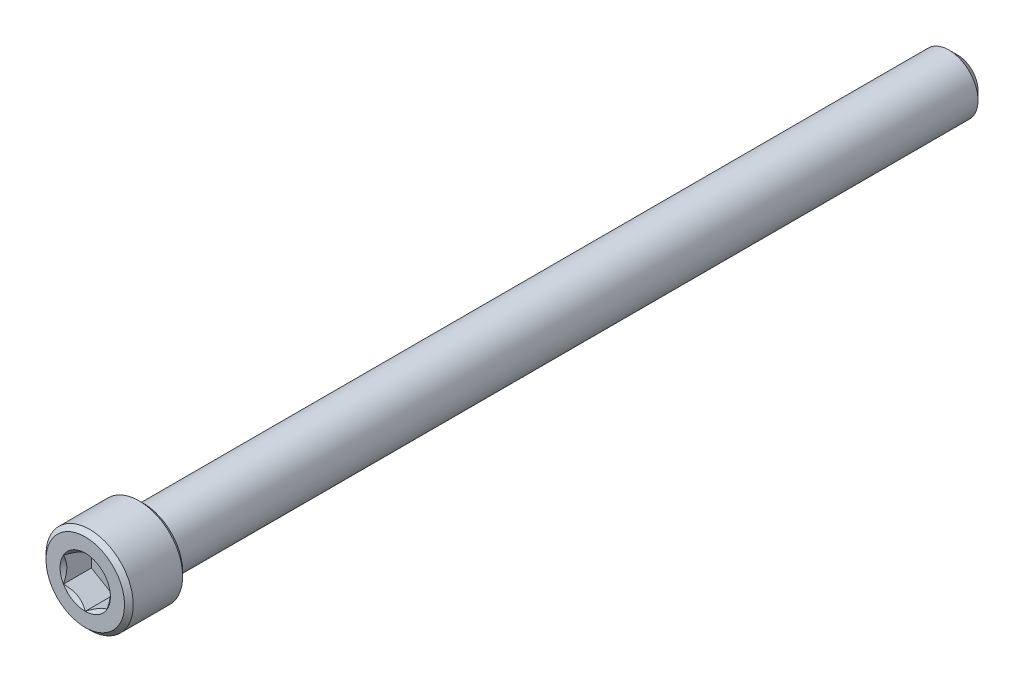
ISO-10303-21;
HEADER;
FILE_DESCRIPTION(('STEP AP214'),'2;1');
FILE_NAME('part.step','',(''),(''),'','','');
FILE_SCHEMA(('AUTOMOTIVE_DESIGN { 1 0 10303 214 1 1 1 1 }'));
ENDSEC;
DATA;
#1=APPLICATION_CONTEXT('core data for automotive mechanical design processes');
#2=APPLICATION_PROTOCOL_DEFINITION('international standard','automotive_design',2000,#1);
#3=PRODUCT_CONTEXT('',#1,'mechanical');
#4=PRODUCT('Part','Part','',(#3));
#5=PRODUCT_RELATED_PRODUCT_CATEGORY('part','',(#4));
#6=PRODUCT_DEFINITION_FORMATION('','',#4);
#7=PRODUCT_DEFINITION_CONTEXT('part definition',#1,'design');
#8=PRODUCT_DEFINITION('design','',#6,#7);
#9=PRODUCT_DEFINITION_SHAPE('','',#8);
#10=(LENGTH_UNIT() NAMED_UNIT(*) SI_UNIT(.MILLI.,.METRE.));
#11=(NAMED_UNIT(*) PLANE_ANGLE_UNIT() SI_UNIT($,.RADIAN.));
#12=(NAMED_UNIT(*) SI_UNIT($,.STERADIAN.) SOLID_ANGLE_UNIT());
#13=UNCERTAINTY_MEASURE_WITH_UNIT(LENGTH_MEASURE(1.E-05),#10,'distance_accuracy_value','');
#14=(GEOMETRIC_REPRESENTATION_CONTEXT(3) GLOBAL_UNCERTAINTY_ASSIGNED_CONTEXT((#13)) GLOBAL_UNIT_ASSIGNED_CONTEXT((#10,
#11,#12)) REPRESENTATION_CONTEXT('',''));
#15=CARTESIAN_POINT('',(0.,0.,0.));
#16=DIRECTION('',(0.,0.,1.));
#17=DIRECTION('',(1.,0.,0.));
#18=AXIS2_PLACEMENT_3D('',#15,#16,#17);
#19=CARTESIAN_POINT('',(0.,0.,47.625));
#20=DIRECTION('',(0.,0.,1.));
#21=DIRECTION('',(0.,-1.,0.));
#22=AXIS2_PLACEMENT_3D('',#19,#20,#21);
#23=CYLINDRICAL_SURFACE('',#22,4.7625);
#24=CARTESIAN_POINT('',(0.,0.,41.75125));
#25=DIRECTION('',(0.,0.,1.));
#26=DIRECTION('',(0.,-1.,0.));
#27=AXIS2_PLACEMENT_3D('',#24,#25,#26);
#28=CIRCLE('',#27,4.7625);
#29=CARTESIAN_POINT('',(0.,-4.7625,41.75125));
#30=VERTEX_POINT('',#29);
#31=EDGE_CURVE('E148',#30,#30,#28,.T.);
#32=ORIENTED_EDGE('',*,*,#31,.T.);
#33=EDGE_LOOP('',(#32));
#34=FACE_BOUND('',#33,.T.);
#35=CARTESIAN_POINT('',(0.,0.,47.14875));
#36=DIRECTION('',(0.,0.,-1.));
#37=DIRECTION('',(0.,1.,0.));
#38=AXIS2_PLACEMENT_3D('',#35,#36,#37);
#39=CIRCLE('',#38,4.7625);
#40=CARTESIAN_POINT('',(0.,4.7625,47.14875));
#41=VERTEX_POINT('',#40);
#42=EDGE_CURVE('E145',#41,#41,#39,.T.);
#43=ORIENTED_EDGE('',*,*,#42,.T.);
#44=EDGE_LOOP('',(#43));
#45=FACE_BOUND('',#44,.T.);
#46=ADVANCED_FACE('F33',(#34,#45),#23,.T.);
#47=CARTESIAN_POINT('',(0.,4.7625,47.625));
#48=DIRECTION('',(0.,0.,-1.));
#49=DIRECTION('',(0.,1.,0.));
#50=AXIS2_PLACEMENT_3D('',#47,#48,#49);
#51=PLANE('',#50);
#52=CARTESIAN_POINT('',(0.,0.,47.625));
#53=DIRECTION('',(0.,0.,-1.));
#54=DIRECTION('',(0.,1.,0.));
#55=AXIS2_PLACEMENT_3D('',#52,#53,#54);
#56=CIRCLE('',#55,4.28624999999999);
#57=CARTESIAN_POINT('',(0.,4.28624999999999,47.625));
#58=VERTEX_POINT('',#57);
#59=EDGE_CURVE('E11',#58,#58,#56,.F.);
#60=ORIENTED_EDGE('',*,*,#59,.T.);
#61=EDGE_LOOP('',(#60));
#62=FACE_BOUND('',#61,.T.);
#63=CARTESIAN_POINT('',(0.,0.,47.625));
#64=DIRECTION('',(0.,0.,1.));
#65=DIRECTION('',(1.,0.,0.));
#66=AXIS2_PLACEMENT_3D('',#63,#64,#65);
#67=CIRCLE('',#66,2.7496306570156);
#68=CARTESIAN_POINT('',(0.,2.74963065701559,47.625));
#69=VERTEX_POINT('',#68);
#70=CARTESIAN_POINT('',(-2.38125,1.3748153285078,47.625));
#71=VERTEX_POINT('',#70);
#72=EDGE_CURVE('E104',#69,#71,#67,.T.);
#73=ORIENTED_EDGE('',*,*,#72,.F.);
#74=CARTESIAN_POINT('',(0.,0.,47.625));
#75=DIRECTION('',(0.,0.,1.));
#76=DIRECTION('',(1.,0.,0.));
#77=AXIS2_PLACEMENT_3D('',#74,#75,#76);
#78=CIRCLE('',#77,2.7496306570156);
#79=CARTESIAN_POINT('',(2.38125000000001,1.37481532850779,47.625));
#80=VERTEX_POINT('',#79);
#81=EDGE_CURVE('E91',#80,#69,#78,.T.);
#82=ORIENTED_EDGE('',*,*,#81,.F.);
#83=CARTESIAN_POINT('',(0.,0.,47.625));
#84=DIRECTION('',(0.,0.,1.));
#85=DIRECTION('',(1.,0.,0.));
#86=AXIS2_PLACEMENT_3D('',#83,#84,#85);
#87=CIRCLE('',#86,2.7496306570156);
#88=CARTESIAN_POINT('',(2.38125000000001,-1.37481532850781,47.625));
#89=VERTEX_POINT('',#88);
#90=EDGE_CURVE('E101',#89,#80,#87,.T.);
#91=ORIENTED_EDGE('',*,*,#90,.F.);
#92=CARTESIAN_POINT('',(0.,0.,47.625));
#93=DIRECTION('',(0.,0.,1.));
#94=DIRECTION('',(1.,0.,0.));
#95=AXIS2_PLACEMENT_3D('',#92,#93,#94);
#96=CIRCLE('',#95,2.7496306570156);
#97=CARTESIAN_POINT('',(0.,-2.74963065701561,47.625));
#98=VERTEX_POINT('',#97);
#99=EDGE_CURVE('E251',#98,#89,#96,.T.);
#100=ORIENTED_EDGE('',*,*,#99,.F.);
#101=CARTESIAN_POINT('',(0.,0.,47.625));
#102=DIRECTION('',(0.,0.,1.));
#103=DIRECTION('',(1.,0.,0.));
#104=AXIS2_PLACEMENT_3D('',#101,#102,#103);
#105=CIRCLE('',#104,2.7496306570156);
#106=CARTESIAN_POINT('',(-2.38125000000001,-1.37481532850781,47.625));
#107=VERTEX_POINT('',#106);
#108=EDGE_CURVE('E117',#107,#98,#105,.T.);
#109=ORIENTED_EDGE('',*,*,#108,.F.);
#110=CARTESIAN_POINT('',(0.,0.,47.625));
#111=DIRECTION('',(0.,0.,1.));
#112=DIRECTION('',(1.,0.,0.));
#113=AXIS2_PLACEMENT_3D('',#110,#111,#112);
#114=CIRCLE('',#113,2.7496306570156);
#115=EDGE_CURVE('E252',#71,#107,#114,.T.);
#116=ORIENTED_EDGE('',*,*,#115,.F.);
#117=EDGE_LOOP('',(#73,#82,#91,#100,#109,#116));
#118=FACE_BOUND('',#117,.T.);
#119=ADVANCED_FACE('F99',(#62,#118),#51,.F.);
#120=CARTESIAN_POINT('',(0.,0.,-47.625));
#121=DIRECTION('',(0.,0.,1.));
#122=DIRECTION('',(0.,-1.,0.));
#123=AXIS2_PLACEMENT_3D('',#120,#121,#122);
#124=PLANE('',#123);
#125=CARTESIAN_POINT('',(0.,0.,-47.625));
#126=DIRECTION('',(0.,0.,1.));
#127=DIRECTION('',(0.,-1.,0.));
#128=AXIS2_PLACEMENT_3D('',#125,#126,#127);
#129=CIRCLE('',#128,2.22249999999998);
#130=CARTESIAN_POINT('',(0.,-2.22249999999996,-47.625));
#131=VERTEX_POINT('',#130);
#132=EDGE_CURVE('E142',#131,#131,#129,.T.);
#133=ORIENTED_EDGE('',*,*,#132,.F.);
#134=EDGE_LOOP('',(#133));
#135=FACE_BOUND('',#134,.T.);
#136=ADVANCED_FACE('F171',(#135),#124,.F.);
#137=CARTESIAN_POINT('',(0.,0.,-47.625));
#138=DIRECTION('',(0.,0.,1.));
#139=DIRECTION('',(0.,-1.,0.));
#140=AXIS2_PLACEMENT_3D('',#137,#138,#139);
#141=CONICAL_SURFACE('',#140,2.22249999999998,0.785398163397451);
#142=CARTESIAN_POINT('',(0.,0.,-46.6725));
#143=DIRECTION('',(0.,0.,1.));
#144=DIRECTION('',(0.,-1.,0.));
#145=AXIS2_PLACEMENT_3D('',#142,#143,#144);
#146=CIRCLE('',#145,3.17499999999998);
#147=CARTESIAN_POINT('',(0.,-3.17499999999996,-46.6725));
#148=VERTEX_POINT('',#147);
#149=EDGE_CURVE('E123',#148,#148,#146,.T.);
#150=ORIENTED_EDGE('',*,*,#149,.F.);
#151=EDGE_LOOP('',(#150));
#152=FACE_BOUND('',#151,.T.);
#153=ORIENTED_EDGE('',*,*,#132,.T.);
#154=EDGE_LOOP('',(#153));
#155=FACE_BOUND('',#154,.T.);
#156=ADVANCED_FACE('F176',(#152,#155),#141,.T.);
#157=CARTESIAN_POINT('',(0.,0.,47.625));
#158=DIRECTION('',(0.,0.,1.));
#159=DIRECTION('',(0.,-1.,0.));
#160=AXIS2_PLACEMENT_3D('',#157,#158,#159);
#161=CYLINDRICAL_SURFACE('',#160,3.17499999999999);
#162=CARTESIAN_POINT('',(0.,0.,41.275));
#163=DIRECTION('',(0.,0.,1.));
#164=DIRECTION('',(0.,-1.,0.));
#165=AXIS2_PLACEMENT_3D('',#162,#163,#164);
#166=CIRCLE('',#165,3.175);
#167=CARTESIAN_POINT('',(0.,-3.175,41.275));
#168=VERTEX_POINT('',#167);
#169=EDGE_CURVE('E120',#168,#168,#166,.T.);
#170=ORIENTED_EDGE('',*,*,#169,.F.);
#171=EDGE_LOOP('',(#170));
#172=FACE_BOUND('',#171,.T.);
#173=ORIENTED_EDGE('',*,*,#149,.T.);
#174=EDGE_LOOP('',(#173));
#175=FACE_BOUND('',#174,.T.);
#176=ADVANCED_FACE('F188',(#172,#175),#161,.T.);
#177=CARTESIAN_POINT('',(0.,3.175,41.275));
#178=DIRECTION('',(0.,0.,1.));
#179=DIRECTION('',(0.,-1.,0.));
#180=AXIS2_PLACEMENT_3D('',#177,#178,#179);
#181=PLANE('',#180);
#182=CARTESIAN_POINT('',(0.,0.,41.275));
#183=DIRECTION('',(0.,0.,1.));
#184=DIRECTION('',(0.,-1.,0.));
#185=AXIS2_PLACEMENT_3D('',#182,#183,#184);
#186=CIRCLE('',#185,4.28625);
#187=CARTESIAN_POINT('',(0.,-4.28625,41.275));
#188=VERTEX_POINT('',#187);
#189=EDGE_CURVE('E41',#188,#188,#186,.F.);
#190=ORIENTED_EDGE('',*,*,#189,.T.);
#191=EDGE_LOOP('',(#190));
#192=FACE_BOUND('',#191,.T.);
#193=ORIENTED_EDGE('',*,*,#169,.T.);
#194=EDGE_LOOP('',(#193));
#195=FACE_BOUND('',#194,.T.);
#196=ADVANCED_FACE('F153',(#192,#195),#181,.F.);
#197=CARTESIAN_POINT('',(2.38125000000001,1.37481532850779,44.577));
#198=DIRECTION('',(0.5,0.866025403784439,0.));
#199=DIRECTION('',(-0.866025403784439,0.5,0.));
#200=AXIS2_PLACEMENT_3D('',#197,#198,#199);
#201=PLANE('',#200);
#202=DIRECTION('',(0.,0.,1.));
#203=VECTOR('',#202,1.);
#204=CARTESIAN_POINT('',(2.38125000000001,1.37481532850779,44.577));
#205=LINE('',#204,#203);
#206=CARTESIAN_POINT('',(2.38125000000001,1.37481532850779,44.577));
#207=VERTEX_POINT('',#206);
#208=EDGE_CURVE('E114',#207,#80,#205,.T.);
#209=ORIENTED_EDGE('',*,*,#208,.T.);
#210=CARTESIAN_POINT('',(-0.000200000000000902,2.74974612706943,47.6251154773272));
#211=CARTESIAN_POINT('',(0.081656782379049,2.70248609172789,47.5778948967095));
#212=CARTESIAN_POINT('',(0.16488233377176,2.65443579722785,47.5334475752929));
#213=CARTESIAN_POINT('',(0.33458848083804,2.556455907536,47.4520654569856));
#214=CARTESIAN_POINT('',(0.421085217353103,2.50651699342501,47.4151759430951));
#215=CARTESIAN_POINT('',(0.595501774009043,2.40581754748857,47.3519834131659));
#216=CARTESIAN_POINT('',(0.683377171180676,2.35508266327639,47.3255215587295));
#217=CARTESIAN_POINT('',(0.861062594070878,2.25249593653965,47.2847515156161));
#218=CARTESIAN_POINT('',(0.950867191185874,2.20064722822085,47.2704128915306));
#219=CARTESIAN_POINT('',(1.10563960313034,2.11128933452158,47.2574757847701));
#220=CARTESIAN_POINT('',(1.17040744896962,2.07389560129144,47.2555606046532));
#221=CARTESIAN_POINT('',(1.29983727933558,1.99916925388849,47.2587866227677));
#222=CARTESIAN_POINT('',(1.36449921879336,1.96183666573621,47.2639302948571));
#223=CARTESIAN_POINT('',(1.4932125485774,1.8875239901371,47.2809813108716));
#224=CARTESIAN_POINT('',(1.55726317423486,1.85054434417201,47.2928962213493));
#225=CARTESIAN_POINT('',(1.68425683890528,1.77722451768916,47.322835672352));
#226=CARTESIAN_POINT('',(1.74719996243583,1.74088428837516,47.3408597445185));
#227=CARTESIAN_POINT('',(1.90842615073219,1.64780030516184,47.3943688075524));
#228=CARTESIAN_POINT('',(2.00570949128785,1.59163374230437,47.4338874208722));
#229=CARTESIAN_POINT('',(2.14875606262558,1.50904576583588,47.5006003435508));
#230=CARTESIAN_POINT('',(2.19589628894397,1.48182934348129,47.5240402091113));
#231=CARTESIAN_POINT('',(2.28930352636665,1.42790064981105,47.5730566766595));
#232=CARTESIAN_POINT('',(2.33557105249683,1.40118808114505,47.5986319667669));
#233=CARTESIAN_POINT('',(2.38145000000001,1.37469985845395,47.6251154773272));
#234=B_SPLINE_CURVE_WITH_KNOTS('',3,(#210,#211,#212,#213,#214,#215,#216,#217,#218,#219,#220,
#221,#222,#223,#224,#225,#226,#227,#228,#229,#230,#231,#232,#233),.UNSPECIFIED.,.F.,.F.,(4,2,2,
2,2,2,2,2,2,2,2,4),(0.,0.317196610611953,0.636241461041222,0.950218950629226,1.26340583824126,
1.48752413747845,1.71172100167748,1.93616888974083,2.16059957440837,2.51709639744764,
2.694861473691,2.87251813383155),.UNSPECIFIED.);
#235=EDGE_CURVE('E88',#69,#80,#234,.T.);
#236=ORIENTED_EDGE('',*,*,#235,.F.);
#237=DIRECTION('',(0.,0.,1.));
#238=VECTOR('',#237,1.);
#239=CARTESIAN_POINT('',(0.,2.74963065701559,44.577));
#240=LINE('',#239,#238);
#241=CARTESIAN_POINT('',(0.,2.74963065701559,44.577));
#242=VERTEX_POINT('',#241);
#243=EDGE_CURVE('E138',#242,#69,#240,.T.);
#244=ORIENTED_EDGE('',*,*,#243,.F.);
#245=DIRECTION('',(-0.866025403784439,0.5,0.));
#246=VECTOR('',#245,1.);
#247=CARTESIAN_POINT('',(2.38125000000001,1.37481532850779,44.577));
#248=LINE('',#247,#246);
#249=EDGE_CURVE('E48',#207,#242,#248,.T.);
#250=ORIENTED_EDGE('',*,*,#249,.F.);
#251=EDGE_LOOP('',(#209,#236,#244,#250));
#252=FACE_BOUND('',#251,.T.);
#253=ADVANCED_FACE('F119',(#252),#201,.F.);
#254=CARTESIAN_POINT('',(2.38125000000001,-1.37481532850781,44.577));
#255=DIRECTION('',(1.,0.,0.));
#256=DIRECTION('',(0.,1.,0.));
#257=AXIS2_PLACEMENT_3D('',#254,#255,#256);
#258=PLANE('',#257);
#259=DIRECTION('',(0.,0.,1.));
#260=VECTOR('',#259,1.);
#261=CARTESIAN_POINT('',(2.38125000000001,-1.37481532850781,44.577));
#262=LINE('',#261,#260);
#263=CARTESIAN_POINT('',(2.38125000000001,-1.37481532850781,44.577));
#264=VERTEX_POINT('',#263);
#265=EDGE_CURVE('E116',#264,#89,#262,.T.);
#266=ORIENTED_EDGE('',*,*,#265,.T.);
#267=CARTESIAN_POINT('',(2.38125000000001,-2.74194290589388,48.5069808945799));
#268=CARTESIAN_POINT('',(2.38125000000001,-2.6751796105604,48.4565846679781));
#269=CARTESIAN_POINT('',(2.38125000000001,-2.60804251112753,48.4066755875907));
#270=CARTESIAN_POINT('',(2.38125000000001,-2.47287325055308,48.3080498309857));
#271=CARTESIAN_POINT('',(2.38125000000001,-2.40484086895313,48.2593334572448));
#272=CARTESIAN_POINT('',(2.38125000000001,-2.26723593505442,48.1629648544534));
#273=CARTESIAN_POINT('',(2.38125000000001,-2.1976555334605,48.1153237954326));
#274=CARTESIAN_POINT('',(2.38125000000001,-2.05731367842204,48.0218199233866));
#275=CARTESIAN_POINT('',(2.38125000000001,-1.98655230892574,47.9759569847287));
#276=CARTESIAN_POINT('',(2.38125000000001,-1.83957751909226,47.8838459007133));
#277=CARTESIAN_POINT('',(2.38125000000001,-1.76328361992076,47.8377255173928));
#278=CARTESIAN_POINT('',(2.38125000000001,-1.6089135770446,47.7485183038905));
#279=CARTESIAN_POINT('',(2.38125000000001,-1.53083712149137,47.7054320099754));
#280=CARTESIAN_POINT('',(2.38125000000001,-1.37291620334514,47.6232265014712));
#281=CARTESIAN_POINT('',(2.38125000000001,-1.29307799938228,47.5840953578519));
#282=CARTESIAN_POINT('',(2.38125000000001,-1.13121425093133,47.5106679503152));
#283=CARTESIAN_POINT('',(2.38125000000001,-1.04918943681796,47.4763700954538));
#284=CARTESIAN_POINT('',(2.38125000000001,-0.889535256759278,47.4163546314156));
#285=CARTESIAN_POINT('',(2.38125000000001,-0.812083865770265,47.390168478432));
#286=CARTESIAN_POINT('',(2.38125000000001,-0.655316366527669,47.3440097514868));
#287=CARTESIAN_POINT('',(2.38125000000001,-0.576000130216837,47.3240376055837));
#288=CARTESIAN_POINT('',(2.38125000000001,-0.417295761573382,47.2916821452488));
#289=CARTESIAN_POINT('',(2.38125000000001,-0.337934576883854,47.2791688083547));
#290=CARTESIAN_POINT('',(2.38125000000001,-0.178363852969591,47.2619738601659));
#291=CARTESIAN_POINT('',(2.38125000000001,-0.0981544619617743,47.2572909026126));
#292=CARTESIAN_POINT('',(2.38125000000001,0.0594188034321217,47.2561044408392));
#293=CARTESIAN_POINT('',(2.38125000000001,0.136780588525985,47.2593110105046));
#294=CARTESIAN_POINT('',(2.38125000000001,0.290840960607331,47.2730870567428));
#295=CARTESIAN_POINT('',(2.38125000000001,0.367539482435402,47.2836572485871));
#296=CARTESIAN_POINT('',(2.38125000000001,0.521017492835381,47.3117628298525));
#297=CARTESIAN_POINT('',(2.38125000000001,0.597774958394041,47.3294167489315));
#298=CARTESIAN_POINT('',(2.38125000000001,0.749609814257003,47.3707513962434));
#299=CARTESIAN_POINT('',(2.38125000000001,0.82468734456802,47.3944316201904));
#300=CARTESIAN_POINT('',(2.38125000000001,1.06107814410025,47.477894862956));
#301=CARTESIAN_POINT('',(2.38125000000001,1.21904786221809,47.5471839270396));
#302=CARTESIAN_POINT('',(2.38125000000001,1.45021000267341,47.6626640838597));
#303=CARTESIAN_POINT('',(2.38125000000001,1.52644290442584,47.7031730572583));
#304=CARTESIAN_POINT('',(2.38125000000001,1.67717618538172,47.7873026892371));
#305=CARTESIAN_POINT('',(2.38125000000001,1.75167687358839,47.8309227870999));
#306=CARTESIAN_POINT('',(2.38125000000001,1.89548152088327,47.918412556489));
#307=CARTESIAN_POINT('',(2.38125000000001,1.96485959608998,47.9621617927418));
#308=CARTESIAN_POINT('',(2.38125000000001,2.10242624411169,48.0515011587307));
#309=CARTESIAN_POINT('',(2.38125000000001,2.17061472626633,48.0970914279041));
#310=CARTESIAN_POINT('',(2.38125000000001,2.30540317317354,48.1894060050932));
#311=CARTESIAN_POINT('',(2.38125000000001,2.37201154222166,48.2361180928962));
#312=CARTESIAN_POINT('',(2.38125000000001,2.50431800054459,48.3307775780183));
#313=CARTESIAN_POINT('',(2.38125000000001,2.57001633510792,48.3787246320963));
#314=CARTESIAN_POINT('',(2.38125000000001,2.63533378855947,48.4271767335425));
#315=B_SPLINE_CURVE_WITH_KNOTS('',3,(#267,#268,#269,#270,#271,#272,#273,#274,#275,#276,#277,
#278,#279,#280,#281,#282,#283,#284,#285,#286,#287,#288,#289,#290,#291,#292,#293,#294,#295,#296,
#297,#298,#299,#300,#301,#302,#303,#304,#305,#306,#307,#308,#309,#310,#311,#312,#313,#314),
.UNSPECIFIED.,.F.,.F.,(4,2,2,2,2,2,2,2,2,2,2,2,2,2,2,2,2,2,2,2,2,2,2,4),(0.,0.250951284009989,
0.501965564827891,0.754924775973594,1.00786608164543,1.27526207798893,1.54270521780083,
1.8093160202934,2.0758388581252,2.32089852590464,2.56597507114536,2.80664400307698,
3.04727155311265,3.27918940971451,3.51112979698762,3.74712477407483,3.98310000940112,
4.49898139184705,4.75794323931355,5.01685853149448,5.26288960015362,5.50893933794673,
5.75299038397143,5.99697431627972),.UNSPECIFIED.);
#316=EDGE_CURVE('E111',#80,#89,#315,.F.);
#317=ORIENTED_EDGE('',*,*,#316,.F.);
#318=ORIENTED_EDGE('',*,*,#208,.F.);
#319=DIRECTION('',(0.,1.,0.));
#320=VECTOR('',#319,1.);
#321=CARTESIAN_POINT('',(2.38125000000001,-1.37481532850781,44.577));
#322=LINE('',#321,#320);
#323=EDGE_CURVE('E55',#264,#207,#322,.T.);
#324=ORIENTED_EDGE('',*,*,#323,.F.);
#325=EDGE_LOOP('',(#266,#317,#318,#324));
#326=FACE_BOUND('',#325,.T.);
#327=ADVANCED_FACE('F113',(#326),#258,.F.);
#328=CARTESIAN_POINT('',(0.,-2.74963065701561,44.577));
#329=DIRECTION('',(0.5,-0.866025403784439,0.));
#330=DIRECTION('',(0.866025403784439,0.5,0.));
#331=AXIS2_PLACEMENT_3D('',#328,#329,#330);
#332=PLANE('',#331);
#333=DIRECTION('',(0.,0.,1.));
#334=VECTOR('',#333,1.);
#335=CARTESIAN_POINT('',(0.,-2.74963065701561,44.577));
#336=LINE('',#335,#334);
#337=CARTESIAN_POINT('',(0.,-2.74963065701561,44.577));
#338=VERTEX_POINT('',#337);
#339=EDGE_CURVE('E125',#338,#98,#336,.T.);
#340=ORIENTED_EDGE('',*,*,#339,.T.);
#341=CARTESIAN_POINT('',(2.38145000000001,-1.37469985845397,47.6251154773272));
#342=CARTESIAN_POINT('',(2.29959321762096,-1.42195989379551,47.5778948967095));
#343=CARTESIAN_POINT('',(2.21636766622825,-1.47001018829555,47.5334475752929));
#344=CARTESIAN_POINT('',(2.04666151916197,-1.5679900779874,47.4520654569856));
#345=CARTESIAN_POINT('',(1.9601647826469,-1.61792899209839,47.4151759430951));
#346=CARTESIAN_POINT('',(1.78574822599096,-1.71862843803483,47.3519834131659));
#347=CARTESIAN_POINT('',(1.69787282881933,-1.76936332224701,47.3255215587295));
#348=CARTESIAN_POINT('',(1.52018740592913,-1.87195004898374,47.2847515156161));
#349=CARTESIAN_POINT('',(1.43038280881414,-1.92379875730255,47.2704128915305));
#350=CARTESIAN_POINT('',(1.27561039686967,-2.01315665100182,47.2574757847701));
#351=CARTESIAN_POINT('',(1.21084255103039,-2.05055038423196,47.2555606046532));
#352=CARTESIAN_POINT('',(1.08141272066443,-2.12527673163491,47.2587866227677));
#353=CARTESIAN_POINT('',(1.01675078120665,-2.16260931978718,47.2639302948571));
#354=CARTESIAN_POINT('',(0.888037451422611,-2.23692199538629,47.2809813108716));
#355=CARTESIAN_POINT('',(0.823986825765154,-2.27390164135139,47.2928962213493));
#356=CARTESIAN_POINT('',(0.696993161094734,-2.34722146783423,47.322835672352));
#357=CARTESIAN_POINT('',(0.634050037564183,-2.38356169714823,47.3408597445184));
#358=CARTESIAN_POINT('',(0.472823849267824,-2.47664568036155,47.3943688075524));
#359=CARTESIAN_POINT('',(0.375540508712164,-2.53281224321903,47.4338874208722));
#360=CARTESIAN_POINT('',(0.232493937374433,-2.61540021968752,47.5006003435508));
#361=CARTESIAN_POINT('',(0.185353711056038,-2.64261664204211,47.5240402091113));
#362=CARTESIAN_POINT('',(0.0919464736333623,-2.69654533571235,47.5730566766595));
#363=CARTESIAN_POINT('',(0.0456789475031775,-2.72325790437835,47.5986319667669));
#364=CARTESIAN_POINT('',(-0.00020000000000243,-2.74974612706944,47.6251154773272));
#365=B_SPLINE_CURVE_WITH_KNOTS('',3,(#341,#342,#343,#344,#345,#346,#347,#348,#349,#350,#351,
#352,#353,#354,#355,#356,#357,#358,#359,#360,#361,#362,#363,#364),.UNSPECIFIED.,.F.,.F.,(4,2,2,
2,2,2,2,2,2,2,2,4),(0.,0.317196610611948,0.636241461041217,0.95021895062922,1.26340583824126,
1.48752413747844,1.71172100167747,1.93616888974082,2.16059957440836,2.51709639744763,
2.69486147369099,2.87251813383155),.UNSPECIFIED.);
#366=EDGE_CURVE('E249',#89,#98,#365,.T.);
#367=ORIENTED_EDGE('',*,*,#366,.F.);
#368=ORIENTED_EDGE('',*,*,#265,.F.);
#369=DIRECTION('',(0.866025403784439,0.5,0.));
#370=VECTOR('',#369,1.);
#371=CARTESIAN_POINT('',(0.,-2.74963065701561,44.577));
#372=LINE('',#371,#370);
#373=EDGE_CURVE('E240',#338,#264,#372,.T.);
#374=ORIENTED_EDGE('',*,*,#373,.F.);
#375=EDGE_LOOP('',(#340,#367,#368,#374));
#376=FACE_BOUND('',#375,.T.);
#377=ADVANCED_FACE('F207',(#376),#332,.F.);
#378=CARTESIAN_POINT('',(-2.38125000000001,-1.37481532850781,44.577));
#379=DIRECTION('',(-0.5,-0.866025403784439,0.));
#380=DIRECTION('',(0.866025403784439,-0.5,0.));
#381=AXIS2_PLACEMENT_3D('',#378,#379,#380);
#382=PLANE('',#381);
#383=DIRECTION('',(0.,0.,1.));
#384=VECTOR('',#383,1.);
#385=CARTESIAN_POINT('',(-2.38125000000001,-1.37481532850781,44.577));
#386=LINE('',#385,#384);
#387=CARTESIAN_POINT('',(-2.38125000000001,-1.37481532850781,44.577));
#388=VERTEX_POINT('',#387);
#389=EDGE_CURVE('E132',#388,#107,#386,.T.);
#390=ORIENTED_EDGE('',*,*,#389,.T.);
#391=CARTESIAN_POINT('',(0.000199999999999976,-2.74974612706944,47.6251154773272));
#392=CARTESIAN_POINT('',(-0.0816567823790487,-2.7024860917279,47.5778948967095));
#393=CARTESIAN_POINT('',(-0.164882333771758,-2.65443579722787,47.5334475752929));
#394=CARTESIAN_POINT('',(-0.334588480838037,-2.55645590753602,47.4520654569856));
#395=CARTESIAN_POINT('',(-0.4210852173531,-2.50651699342502,47.4151759430951));
#396=CARTESIAN_POINT('',(-0.595501774009039,-2.40581754748859,47.3519834131659));
#397=CARTESIAN_POINT('',(-0.683377171180671,-2.3550826632764,47.3255215587295));
#398=CARTESIAN_POINT('',(-0.861062594070872,-2.25249593653967,47.2847515156161));
#399=CARTESIAN_POINT('',(-0.950867191185867,-2.20064722822086,47.2704128915305));
#400=CARTESIAN_POINT('',(-1.10563960313034,-2.1112893345216,47.2574757847701));
#401=CARTESIAN_POINT('',(-1.17040744896961,-2.07389560129146,47.2555606046532));
#402=CARTESIAN_POINT('',(-1.29983727933557,-1.9991692538885,47.2587866227677));
#403=CARTESIAN_POINT('',(-1.36449921879335,-1.96183666573623,47.2639302948571));
#404=CARTESIAN_POINT('',(-1.49321254857739,-1.88752399013712,47.2809813108716));
#405=CARTESIAN_POINT('',(-1.55726317423485,-1.85054434417202,47.2928962213493));
#406=CARTESIAN_POINT('',(-1.68425683890527,-1.77722451768918,47.322835672352));
#407=CARTESIAN_POINT('',(-1.74719996243582,-1.74088428837518,47.3408597445184));
#408=CARTESIAN_POINT('',(-1.90842615073218,-1.64780030516186,47.3943688075524));
#409=CARTESIAN_POINT('',(-2.00570949128784,-1.59163374230439,47.4338874208722));
#410=CARTESIAN_POINT('',(-2.14875606262557,-1.50904576583589,47.5006003435508));
#411=CARTESIAN_POINT('',(-2.19589628894396,-1.48182934348131,47.5240402091113));
#412=CARTESIAN_POINT('',(-2.28930352636664,-1.42790064981107,47.5730566766595));
#413=CARTESIAN_POINT('',(-2.33557105249683,-1.40118808114507,47.5986319667669));
#414=CARTESIAN_POINT('',(-2.38145000000001,-1.37469985845397,47.6251154773272));
#415=B_SPLINE_CURVE_WITH_KNOTS('',3,(#391,#392,#393,#394,#395,#396,#397,#398,#399,#400,#401,
#402,#403,#404,#405,#406,#407,#408,#409,#410,#411,#412,#413,#414),.UNSPECIFIED.,.F.,.F.,(4,2,2,
2,2,2,2,2,2,2,2,4),(0.,0.317196610611946,0.636241461041215,0.950218950629218,1.26340583824126,
1.48752413747844,1.71172100167746,1.93616888974082,2.16059957440836,2.51709639744762,
2.69486147369099,2.87251813383155),.UNSPECIFIED.);
#416=EDGE_CURVE('E222',#98,#107,#415,.T.);
#417=ORIENTED_EDGE('',*,*,#416,.F.);
#418=ORIENTED_EDGE('',*,*,#339,.F.);
#419=DIRECTION('',(0.866025403784439,-0.5,0.));
#420=VECTOR('',#419,1.);
#421=CARTESIAN_POINT('',(-2.38125000000001,-1.37481532850781,44.577));
#422=LINE('',#421,#420);
#423=EDGE_CURVE('E238',#388,#338,#422,.T.);
#424=ORIENTED_EDGE('',*,*,#423,.F.);
#425=EDGE_LOOP('',(#390,#417,#418,#424));
#426=FACE_BOUND('',#425,.T.);
#427=ADVANCED_FACE('F203',(#426),#382,.F.);
#428=CARTESIAN_POINT('',(-2.38125,1.37481532850779,44.577));
#429=DIRECTION('',(-1.,0.,0.));
#430=DIRECTION('',(0.,-1.,0.));
#431=AXIS2_PLACEMENT_3D('',#428,#429,#430);
#432=PLANE('',#431);
#433=DIRECTION('',(0.,0.,1.));
#434=VECTOR('',#433,1.);
#435=CARTESIAN_POINT('',(-2.38125,1.37481532850779,44.577));
#436=LINE('',#435,#434);
#437=CARTESIAN_POINT('',(-2.38125,1.37481532850779,44.577));
#438=VERTEX_POINT('',#437);
#439=EDGE_CURVE('E135',#438,#71,#436,.T.);
#440=ORIENTED_EDGE('',*,*,#439,.T.);
#441=CARTESIAN_POINT('',(-2.38125000000001,-2.74194290589388,48.5069808945799));
#442=CARTESIAN_POINT('',(-2.38125000000001,-2.67517961056041,48.4565846679781));
#443=CARTESIAN_POINT('',(-2.38125000000001,-2.60804251112753,48.4066755875907));
#444=CARTESIAN_POINT('',(-2.38125000000001,-2.47287325055308,48.3080498309857));
#445=CARTESIAN_POINT('',(-2.38125000000001,-2.40484086895313,48.2593334572448));
#446=CARTESIAN_POINT('',(-2.38125000000001,-2.26723593505442,48.1629648544534));
#447=CARTESIAN_POINT('',(-2.38125000000001,-2.1976555334605,48.1153237954326));
#448=CARTESIAN_POINT('',(-2.38125000000001,-2.05731367842204,48.0218199233866));
#449=CARTESIAN_POINT('',(-2.38125000000001,-1.98655230892574,47.9759569847287));
#450=CARTESIAN_POINT('',(-2.38125000000001,-1.83957751909226,47.8838459007133));
#451=CARTESIAN_POINT('',(-2.38125000000001,-1.76328361992076,47.8377255173928));
#452=CARTESIAN_POINT('',(-2.38125000000001,-1.6089135770446,47.7485183038905));
#453=CARTESIAN_POINT('',(-2.38125000000001,-1.53083712149137,47.7054320099754));
#454=CARTESIAN_POINT('',(-2.38125000000001,-1.37291620334514,47.6232265014712));
#455=CARTESIAN_POINT('',(-2.38125000000001,-1.29307799938228,47.5840953578519));
#456=CARTESIAN_POINT('',(-2.38125000000001,-1.13121425093133,47.5106679503152));
#457=CARTESIAN_POINT('',(-2.38125000000001,-1.04918943681796,47.4763700954538));
#458=CARTESIAN_POINT('',(-2.38125000000001,-0.889535256759278,47.4163546314156));
#459=CARTESIAN_POINT('',(-2.38125000000001,-0.812083865770265,47.390168478432));
#460=CARTESIAN_POINT('',(-2.38125000000001,-0.655316366527669,47.3440097514868));
#461=CARTESIAN_POINT('',(-2.38125000000001,-0.576000130216837,47.3240376055837));
#462=CARTESIAN_POINT('',(-2.38125000000001,-0.417295761573382,47.2916821452488));
#463=CARTESIAN_POINT('',(-2.38125000000001,-0.337934576883854,47.2791688083547));
#464=CARTESIAN_POINT('',(-2.38125000000001,-0.17836385296959,47.2619738601659));
#465=CARTESIAN_POINT('',(-2.38125000000001,-0.0981544619617738,47.2572909026126));
#466=CARTESIAN_POINT('',(-2.38125000000001,0.0594188034321226,47.2561044408392));
#467=CARTESIAN_POINT('',(-2.38125000000001,0.136780588525986,47.2593110105046));
#468=CARTESIAN_POINT('',(-2.38125000000001,0.290840960607333,47.2730870567428));
#469=CARTESIAN_POINT('',(-2.38125000000001,0.367539482435403,47.2836572485871));
#470=CARTESIAN_POINT('',(-2.38125000000001,0.521017492835383,47.3117628298525));
#471=CARTESIAN_POINT('',(-2.38125000000001,0.597774958394043,47.3294167489315));
#472=CARTESIAN_POINT('',(-2.38125000000001,0.749609814257005,47.3707513962434));
#473=CARTESIAN_POINT('',(-2.38125000000001,0.824687344568022,47.3944316201904));
#474=CARTESIAN_POINT('',(-2.38125000000001,1.06107814410025,47.477894862956));
#475=CARTESIAN_POINT('',(-2.38125,1.2190478622181,47.5471839270396));
#476=CARTESIAN_POINT('',(-2.38125,1.45021000267341,47.6626640838597));
#477=CARTESIAN_POINT('',(-2.38125,1.52644290442584,47.7031730572583));
#478=CARTESIAN_POINT('',(-2.38125,1.67717618538172,47.7873026892371));
#479=CARTESIAN_POINT('',(-2.38125,1.75167687358839,47.8309227870999));
#480=CARTESIAN_POINT('',(-2.38125,1.89548152088328,47.918412556489));
#481=CARTESIAN_POINT('',(-2.38125,1.96485959608998,47.9621617927418));
#482=CARTESIAN_POINT('',(-2.38125,2.10242624411169,48.0515011587307));
#483=CARTESIAN_POINT('',(-2.38125,2.17061472626633,48.0970914279041));
#484=CARTESIAN_POINT('',(-2.38125,2.30540317317354,48.1894060050932));
#485=CARTESIAN_POINT('',(-2.38125,2.37201154222166,48.2361180928962));
#486=CARTESIAN_POINT('',(-2.38125,2.50431800054459,48.3307775780183));
#487=CARTESIAN_POINT('',(-2.38125,2.57001633510792,48.3787246320963));
#488=CARTESIAN_POINT('',(-2.38125,2.63533378855947,48.4271767335425));
#489=B_SPLINE_CURVE_WITH_KNOTS('',3,(#441,#442,#443,#444,#445,#446,#447,#448,#449,#450,#451,
#452,#453,#454,#455,#456,#457,#458,#459,#460,#461,#462,#463,#464,#465,#466,#467,#468,#469,#470,
#471,#472,#473,#474,#475,#476,#477,#478,#479,#480,#481,#482,#483,#484,#485,#486,#487,#488),
.UNSPECIFIED.,.F.,.F.,(4,2,2,2,2,2,2,2,2,2,2,2,2,2,2,2,2,2,2,2,2,2,2,4),(0.,0.250951284009989,
0.501965564827884,0.754924775973594,1.00786608164543,1.27526207798893,1.54270521780083,
1.8093160202934,2.0758388581252,2.32089852590464,2.56597507114536,2.80664400307698,
3.04727155311265,3.27918940971451,3.51112979698762,3.74712477407483,3.98310000940112,
4.49898139184705,4.75794323931355,5.01685853149449,5.26288960015362,5.50893933794674,
5.75299038397143,5.99697431627972),.UNSPECIFIED.);
#490=EDGE_CURVE('E93',#107,#71,#489,.T.);
#491=ORIENTED_EDGE('',*,*,#490,.F.);
#492=ORIENTED_EDGE('',*,*,#389,.F.);
#493=DIRECTION('',(0.,-1.,0.));
#494=VECTOR('',#493,1.);
#495=CARTESIAN_POINT('',(-2.38125,1.37481532850779,44.577));
#496=LINE('',#495,#494);
#497=EDGE_CURVE('E235',#438,#388,#496,.T.);
#498=ORIENTED_EDGE('',*,*,#497,.F.);
#499=EDGE_LOOP('',(#440,#491,#492,#498));
#500=FACE_BOUND('',#499,.T.);
#501=ADVANCED_FACE('F199',(#500),#432,.F.);
#502=CARTESIAN_POINT('',(0.,2.74963065701559,44.577));
#503=DIRECTION('',(-0.5,0.866025403784439,0.));
#504=DIRECTION('',(-0.866025403784439,-0.5,0.));
#505=AXIS2_PLACEMENT_3D('',#502,#503,#504);
#506=PLANE('',#505);
#507=ORIENTED_EDGE('',*,*,#243,.T.);
#508=CARTESIAN_POINT('',(-2.38145,1.37469985845396,47.6251154773272));
#509=CARTESIAN_POINT('',(-2.29959321762095,1.4219598937955,47.5778948967095));
#510=CARTESIAN_POINT('',(-2.21636766622824,1.47001018829553,47.5334475752929));
#511=CARTESIAN_POINT('',(-2.04666151916197,1.56799007798738,47.4520654569856));
#512=CARTESIAN_POINT('',(-1.9601647826469,1.61792899209838,47.4151759430951));
#513=CARTESIAN_POINT('',(-1.78574822599096,1.71862843803481,47.3519834131659));
#514=CARTESIAN_POINT('',(-1.69787282881933,1.769363322247,47.3255215587295));
#515=CARTESIAN_POINT('',(-1.52018740592913,1.87195004898373,47.2847515156161));
#516=CARTESIAN_POINT('',(-1.43038280881414,1.92379875730254,47.2704128915306));
#517=CARTESIAN_POINT('',(-1.27561039686967,2.0131566510018,47.2574757847701));
#518=CARTESIAN_POINT('',(-1.21084255103039,2.05055038423194,47.2555606046532));
#519=CARTESIAN_POINT('',(-1.08141272066443,2.1252767316349,47.2587866227677));
#520=CARTESIAN_POINT('',(-1.01675078120665,2.16260931978717,47.2639302948571));
#521=CARTESIAN_POINT('',(-0.888037451422611,2.23692199538628,47.2809813108716));
#522=CARTESIAN_POINT('',(-0.823986825765154,2.27390164135138,47.2928962213493));
#523=CARTESIAN_POINT('',(-0.696993161094734,2.34722146783422,47.322835672352));
#524=CARTESIAN_POINT('',(-0.634050037564183,2.38356169714822,47.3408597445185));
#525=CARTESIAN_POINT('',(-0.472823849267825,2.47664568036154,47.3943688075524));
#526=CARTESIAN_POINT('',(-0.375540508712164,2.53281224321902,47.4338874208722));
#527=CARTESIAN_POINT('',(-0.23249393737443,2.61540021968751,47.5006003435508));
#528=CARTESIAN_POINT('',(-0.185353711056033,2.6426166420421,47.5240402091113));
#529=CARTESIAN_POINT('',(-0.0919464736333586,2.69654533571234,47.5730566766595));
#530=CARTESIAN_POINT('',(-0.045678947503176,2.72325790437834,47.5986319667669));
#531=CARTESIAN_POINT('',(0.000200000000001031,2.74974612706943,47.6251154773272));
#532=B_SPLINE_CURVE_WITH_KNOTS('',3,(#508,#509,#510,#511,#512,#513,#514,#515,#516,#517,#518,
#519,#520,#521,#522,#523,#524,#525,#526,#527,#528,#529,#530,#531),.UNSPECIFIED.,.F.,.F.,(4,2,2,
2,2,2,2,2,2,2,2,4),(0.,0.317196610611948,0.636241461041215,0.950218950629217,1.26340583824125,
1.48752413747843,1.71172100167746,1.93616888974081,2.16059957440836,2.51709639744763,
2.694861473691,2.87251813383154),.UNSPECIFIED.);
#533=EDGE_CURVE('E243',#71,#69,#532,.T.);
#534=ORIENTED_EDGE('',*,*,#533,.F.);
#535=ORIENTED_EDGE('',*,*,#439,.F.);
#536=DIRECTION('',(-0.866025403784439,-0.5,0.));
#537=VECTOR('',#536,1.);
#538=CARTESIAN_POINT('',(0.,2.74963065701559,44.577));
#539=LINE('',#538,#537);
#540=EDGE_CURVE('E232',#242,#438,#539,.T.);
#541=ORIENTED_EDGE('',*,*,#540,.F.);
#542=EDGE_LOOP('',(#507,#534,#535,#541));
#543=FACE_BOUND('',#542,.T.);
#544=ADVANCED_FACE('F183',(#543),#506,.F.);
#545=CARTESIAN_POINT('',(0.,2.38125,44.577));
#546=DIRECTION('',(0.,0.,-1.));
#547=DIRECTION('',(0.,1.,0.));
#548=AXIS2_PLACEMENT_3D('',#545,#546,#547);
#549=PLANE('',#548);
#550=ORIENTED_EDGE('',*,*,#423,.T.);
#551=ORIENTED_EDGE('',*,*,#373,.T.);
#552=ORIENTED_EDGE('',*,*,#323,.T.);
#553=ORIENTED_EDGE('',*,*,#249,.T.);
#554=ORIENTED_EDGE('',*,*,#540,.T.);
#555=ORIENTED_EDGE('',*,*,#497,.T.);
#556=EDGE_LOOP('',(#550,#551,#552,#553,#554,#555));
#557=FACE_BOUND('',#556,.T.);
#558=ADVANCED_FACE('F180',(#557),#549,.F.);
#559=CARTESIAN_POINT('',(0.,0.,47.625));
#560=DIRECTION('',(0.,0.,1.));
#561=DIRECTION('',(1.,0.,0.));
#562=AXIS2_PLACEMENT_3D('',#559,#560,#561);
#563=CONICAL_SURFACE('',#562,2.7496306570156,0.78539816339745);
#564=ORIENTED_EDGE('',*,*,#533,.T.);
#565=ORIENTED_EDGE('',*,*,#72,.T.);
#566=EDGE_LOOP('',(#564,#565));
#567=FACE_BOUND('',#566,.T.);
#568=ADVANCED_FACE('F182',(#567),#563,.F.);
#569=CARTESIAN_POINT('',(0.,0.,47.625));
#570=DIRECTION('',(0.,0.,1.));
#571=DIRECTION('',(1.,0.,0.));
#572=AXIS2_PLACEMENT_3D('',#569,#570,#571);
#573=CONICAL_SURFACE('',#572,2.7496306570156,0.78539816339745);
#574=ORIENTED_EDGE('',*,*,#416,.T.);
#575=ORIENTED_EDGE('',*,*,#108,.T.);
#576=EDGE_LOOP('',(#574,#575));
#577=FACE_BOUND('',#576,.T.);
#578=ADVANCED_FACE('F214',(#577),#573,.F.);
#579=CARTESIAN_POINT('',(0.,0.,47.625));
#580=DIRECTION('',(0.,0.,1.));
#581=DIRECTION('',(1.,0.,0.));
#582=AXIS2_PLACEMENT_3D('',#579,#580,#581);
#583=CONICAL_SURFACE('',#582,2.7496306570156,0.78539816339745);
#584=ORIENTED_EDGE('',*,*,#316,.T.);
#585=ORIENTED_EDGE('',*,*,#90,.T.);
#586=EDGE_LOOP('',(#584,#585));
#587=FACE_BOUND('',#586,.T.);
#588=ADVANCED_FACE('F110',(#587),#583,.F.);
#589=CARTESIAN_POINT('',(0.,0.,47.625));
#590=DIRECTION('',(0.,0.,1.));
#591=DIRECTION('',(1.,0.,0.));
#592=AXIS2_PLACEMENT_3D('',#589,#590,#591);
#593=CONICAL_SURFACE('',#592,2.7496306570156,0.78539816339745);
#594=ORIENTED_EDGE('',*,*,#366,.T.);
#595=ORIENTED_EDGE('',*,*,#99,.T.);
#596=EDGE_LOOP('',(#594,#595));
#597=FACE_BOUND('',#596,.T.);
#598=ADVANCED_FACE('F264',(#597),#593,.F.);
#599=CARTESIAN_POINT('',(0.,0.,47.625));
#600=DIRECTION('',(0.,0.,1.));
#601=DIRECTION('',(1.,0.,0.));
#602=AXIS2_PLACEMENT_3D('',#599,#600,#601);
#603=CONICAL_SURFACE('',#602,2.7496306570156,0.78539816339745);
#604=ORIENTED_EDGE('',*,*,#490,.T.);
#605=ORIENTED_EDGE('',*,*,#115,.T.);
#606=EDGE_LOOP('',(#604,#605));
#607=FACE_BOUND('',#606,.T.);
#608=ADVANCED_FACE('F269',(#607),#603,.F.);
#609=CARTESIAN_POINT('',(0.,0.,47.625));
#610=DIRECTION('',(0.,0.,1.));
#611=DIRECTION('',(1.,0.,0.));
#612=AXIS2_PLACEMENT_3D('',#609,#610,#611);
#613=CONICAL_SURFACE('',#612,2.7496306570156,0.78539816339745);
#614=ORIENTED_EDGE('',*,*,#235,.T.);
#615=ORIENTED_EDGE('',*,*,#81,.T.);
#616=EDGE_LOOP('',(#614,#615));
#617=FACE_BOUND('',#616,.T.);
#618=ADVANCED_FACE('F90',(#617),#613,.F.);
#619=CARTESIAN_POINT('',(0.,0.,41.75125));
#620=DIRECTION('',(0.,0.,1.));
#621=DIRECTION('',(0.,-1.,0.));
#622=AXIS2_PLACEMENT_3D('',#619,#620,#621);
#623=CONICAL_SURFACE('',#622,4.7625,0.785398163397445);
#624=ORIENTED_EDGE('',*,*,#189,.F.);
#625=EDGE_LOOP('',(#624));
#626=FACE_BOUND('',#625,.T.);
#627=ORIENTED_EDGE('',*,*,#31,.F.);
#628=EDGE_LOOP('',(#627));
#629=FACE_BOUND('',#628,.T.);
#630=ADVANCED_FACE('F156',(#626,#629),#623,.T.);
#631=CARTESIAN_POINT('',(0.,0.,47.625));
#632=DIRECTION('',(0.,0.,-1.));
#633=DIRECTION('',(0.,1.,0.));
#634=AXIS2_PLACEMENT_3D('',#631,#632,#633);
#635=CONICAL_SURFACE('',#634,4.28624999999999,0.78539816339746);
#636=ORIENTED_EDGE('',*,*,#42,.F.);
#637=EDGE_LOOP('',(#636));
#638=FACE_BOUND('',#637,.T.);
#639=ORIENTED_EDGE('',*,*,#59,.F.);
#640=EDGE_LOOP('',(#639));
#641=FACE_BOUND('',#640,.T.);
#642=ADVANCED_FACE('F35',(#638,#641),#635,.T.);
#643=CLOSED_SHELL('',(#46,#119,#136,#156,#176,#196,#253,#327,#377,#427,#501,#544,#558,#568,#578,
#588,#598,#608,#618,#630,#642));
#644=MANIFOLD_SOLID_BREP('B2',#643);
#645=ADVANCED_BREP_SHAPE_REPRESENTATION('',(#18,#644),#14);
#646=SHAPE_DEFINITION_REPRESENTATION(#9,#645);
ENDSEC;
END-ISO-10303-21;
